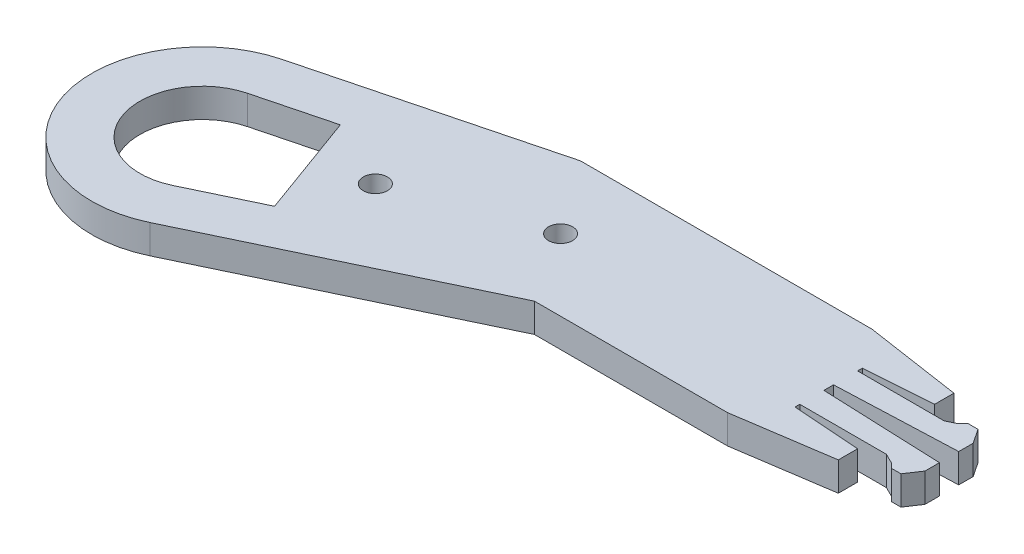
ISO-10303-21;
HEADER;
FILE_DESCRIPTION(('STEP AP214'),'2;1');
FILE_NAME('part.step','',(''),(''),'','','');
FILE_SCHEMA(('AUTOMOTIVE_DESIGN { 1 0 10303 214 1 1 1 1 }'));
ENDSEC;
DATA;
#1=APPLICATION_CONTEXT('core data for automotive mechanical design processes');
#2=APPLICATION_PROTOCOL_DEFINITION('international standard','automotive_design',2000,#1);
#3=PRODUCT_CONTEXT('',#1,'mechanical');
#4=PRODUCT('Part','Part','',(#3));
#5=PRODUCT_RELATED_PRODUCT_CATEGORY('part','',(#4));
#6=PRODUCT_DEFINITION_FORMATION('','',#4);
#7=PRODUCT_DEFINITION_CONTEXT('part definition',#1,'design');
#8=PRODUCT_DEFINITION('design','',#6,#7);
#9=PRODUCT_DEFINITION_SHAPE('','',#8);
#10=(LENGTH_UNIT() NAMED_UNIT(*) SI_UNIT(.MILLI.,.METRE.));
#11=(NAMED_UNIT(*) PLANE_ANGLE_UNIT() SI_UNIT($,.RADIAN.));
#12=(NAMED_UNIT(*) SI_UNIT($,.STERADIAN.) SOLID_ANGLE_UNIT());
#13=UNCERTAINTY_MEASURE_WITH_UNIT(LENGTH_MEASURE(1.E-05),#10,'distance_accuracy_value','');
#14=(GEOMETRIC_REPRESENTATION_CONTEXT(3) GLOBAL_UNCERTAINTY_ASSIGNED_CONTEXT((#13)) GLOBAL_UNIT_ASSIGNED_CONTEXT((#10,
#11,#12)) REPRESENTATION_CONTEXT('',''));
#15=CARTESIAN_POINT('',(0.,0.,0.));
#16=DIRECTION('',(0.,0.,1.));
#17=DIRECTION('',(1.,0.,0.));
#18=AXIS2_PLACEMENT_3D('',#15,#16,#17);
#19=CARTESIAN_POINT('',(-2.87937004662604,-3.,-11.1336978643482));
#20=DIRECTION('',(0.250380004054438,0.,0.968147640378109));
#21=DIRECTION('',(0.968147640378109,0.,-0.250380004054438));
#22=AXIS2_PLACEMENT_3D('',#19,#20,#21);
#23=PLANE('',#22);
#24=DIRECTION('',(0.968147640378109,0.,-0.250380004054438));
#25=VECTOR('',#24,1.);
#26=CARTESIAN_POINT('',(-2.87937004662604,0.,-11.1336978643482));
#27=LINE('',#26,#25);
#28=CARTESIAN_POINT('',(-2.87937004662604,0.,-11.1336978643482));
#29=VERTEX_POINT('',#28);
#30=CARTESIAN_POINT('',(21.7372937873807,0.,-17.5));
#31=VERTEX_POINT('',#30);
#32=EDGE_CURVE('E297',#29,#31,#27,.T.);
#33=ORIENTED_EDGE('',*,*,#32,.T.);
#34=DIRECTION('',(0.,1.,0.));
#35=VECTOR('',#34,1.);
#36=CARTESIAN_POINT('',(21.7372937873807,-3.,-17.5));
#37=LINE('',#36,#35);
#38=CARTESIAN_POINT('',(21.7372937873807,-3.,-17.5));
#39=VERTEX_POINT('',#38);
#40=EDGE_CURVE('E11',#39,#31,#37,.T.);
#41=ORIENTED_EDGE('',*,*,#40,.F.);
#42=DIRECTION('',(0.968147640378109,0.,-0.250380004054438));
#43=VECTOR('',#42,1.);
#44=CARTESIAN_POINT('',(-2.87937004662604,-3.,-11.1336978643482));
#45=LINE('',#44,#43);
#46=CARTESIAN_POINT('',(-2.87937004662604,-3.,-11.1336978643482));
#47=VERTEX_POINT('',#46);
#48=EDGE_CURVE('E54',#47,#39,#45,.T.);
#49=ORIENTED_EDGE('',*,*,#48,.F.);
#50=DIRECTION('',(0.,1.,0.));
#51=VECTOR('',#50,1.);
#52=CARTESIAN_POINT('',(-2.87937004662604,-3.,-11.1336978643482));
#53=LINE('',#52,#51);
#54=EDGE_CURVE('E432',#47,#29,#53,.T.);
#55=ORIENTED_EDGE('',*,*,#54,.T.);
#56=EDGE_LOOP('',(#33,#41,#49,#55));
#57=FACE_BOUND('',#56,.T.);
#58=ADVANCED_FACE('F35',(#57),#23,.F.);
#59=CARTESIAN_POINT('',(0.,-3.,-17.5));
#60=DIRECTION('',(0.,0.,-1.));
#61=DIRECTION('',(-1.,0.,0.));
#62=AXIS2_PLACEMENT_3D('',#59,#60,#61);
#63=PLANE('',#62);
#64=DIRECTION('',(-1.,0.,0.));
#65=VECTOR('',#64,1.);
#66=CARTESIAN_POINT('',(0.,0.,-17.5));
#67=LINE('',#66,#65);
#68=CARTESIAN_POINT('',(52.,0.,-17.5));
#69=VERTEX_POINT('',#68);
#70=EDGE_CURVE('E362',#69,#31,#67,.T.);
#71=ORIENTED_EDGE('',*,*,#70,.F.);
#72=DIRECTION('',(0.,1.,0.));
#73=VECTOR('',#72,1.);
#74=CARTESIAN_POINT('',(52.,-3.,-17.5));
#75=LINE('',#74,#73);
#76=CARTESIAN_POINT('',(52.,-3.,-17.5));
#77=VERTEX_POINT('',#76);
#78=EDGE_CURVE('E45',#77,#69,#75,.T.);
#79=ORIENTED_EDGE('',*,*,#78,.F.);
#80=DIRECTION('',(-1.,0.,0.));
#81=VECTOR('',#80,1.);
#82=CARTESIAN_POINT('',(0.,-3.,-17.5));
#83=LINE('',#82,#81);
#84=EDGE_CURVE('E270',#77,#39,#83,.T.);
#85=ORIENTED_EDGE('',*,*,#84,.T.);
#86=ORIENTED_EDGE('',*,*,#40,.T.);
#87=EDGE_LOOP('',(#71,#79,#85,#86));
#88=FACE_BOUND('',#87,.T.);
#89=ADVANCED_FACE('F621',(#88),#63,.T.);
#90=CARTESIAN_POINT('',(3.71149144254278,-3.,-24.7432762836186));
#91=DIRECTION('',(0.148340452930244,0.,-0.988936352868298));
#92=DIRECTION('',(-0.988936352868298,0.,-0.148340452930244));
#93=AXIS2_PLACEMENT_3D('',#90,#91,#92);
#94=PLANE('',#93);
#95=DIRECTION('',(-0.988936352868298,0.,-0.148340452930244));
#96=VECTOR('',#95,1.);
#97=CARTESIAN_POINT('',(3.71149144254278,0.,-24.7432762836186));
#98=LINE('',#97,#96);
#99=CARTESIAN_POINT('',(62.,0.,-16.));
#100=VERTEX_POINT('',#99);
#101=EDGE_CURVE('E257',#100,#69,#98,.T.);
#102=ORIENTED_EDGE('',*,*,#101,.F.);
#103=DIRECTION('',(0.,1.,0.));
#104=VECTOR('',#103,1.);
#105=CARTESIAN_POINT('',(62.,-3.,-16.));
#106=LINE('',#105,#104);
#107=CARTESIAN_POINT('',(62.,-3.,-16.));
#108=VERTEX_POINT('',#107);
#109=EDGE_CURVE('E253',#108,#100,#106,.T.);
#110=ORIENTED_EDGE('',*,*,#109,.F.);
#111=DIRECTION('',(-0.988936352868298,0.,-0.148340452930244));
#112=VECTOR('',#111,1.);
#113=CARTESIAN_POINT('',(3.71149144254278,-3.,-24.7432762836186));
#114=LINE('',#113,#112);
#115=EDGE_CURVE('E256',#108,#77,#114,.T.);
#116=ORIENTED_EDGE('',*,*,#115,.T.);
#117=ORIENTED_EDGE('',*,*,#78,.T.);
#118=EDGE_LOOP('',(#102,#110,#116,#117));
#119=FACE_BOUND('',#118,.T.);
#120=ADVANCED_FACE('F255',(#119),#94,.T.);
#121=CARTESIAN_POINT('',(62.,-3.,0.));
#122=DIRECTION('',(1.,0.,0.));
#123=DIRECTION('',(0.,0.,-1.));
#124=AXIS2_PLACEMENT_3D('',#121,#122,#123);
#125=PLANE('',#124);
#126=DIRECTION('',(0.,0.,-1.));
#127=VECTOR('',#126,1.);
#128=CARTESIAN_POINT('',(62.,0.,0.));
#129=LINE('',#128,#127);
#130=CARTESIAN_POINT('',(62.,0.,-14.));
#131=VERTEX_POINT('',#130);
#132=EDGE_CURVE('E359',#131,#100,#129,.T.);
#133=ORIENTED_EDGE('',*,*,#132,.F.);
#134=DIRECTION('',(0.,1.,0.));
#135=VECTOR('',#134,1.);
#136=CARTESIAN_POINT('',(62.,-3.,-14.));
#137=LINE('',#136,#135);
#138=CARTESIAN_POINT('',(62.,-3.,-14.));
#139=VERTEX_POINT('',#138);
#140=EDGE_CURVE('E262',#139,#131,#137,.T.);
#141=ORIENTED_EDGE('',*,*,#140,.F.);
#142=DIRECTION('',(0.,0.,-1.));
#143=VECTOR('',#142,1.);
#144=CARTESIAN_POINT('',(62.,-3.,0.));
#145=LINE('',#144,#143);
#146=EDGE_CURVE('E268',#139,#108,#145,.T.);
#147=ORIENTED_EDGE('',*,*,#146,.T.);
#148=ORIENTED_EDGE('',*,*,#109,.T.);
#149=EDGE_LOOP('',(#133,#141,#147,#148));
#150=FACE_BOUND('',#149,.T.);
#151=ADVANCED_FACE('F272',(#150),#125,.T.);
#152=CARTESIAN_POINT('',(-0.680203045685279,-3.,-9.5228426395939));
#153=DIRECTION('',(0.0712470499879097,0.,0.997458699830735));
#154=DIRECTION('',(0.997458699830735,0.,-0.0712470499879097));
#155=AXIS2_PLACEMENT_3D('',#152,#153,#154);
#156=PLANE('',#155);
#157=DIRECTION('',(0.997458699830735,0.,-0.0712470499879097));
#158=VECTOR('',#157,1.);
#159=CARTESIAN_POINT('',(-0.680203045685279,0.,-9.5228426395939));
#160=LINE('',#159,#158);
#161=CARTESIAN_POINT('',(55.,0.,-13.5));
#162=VERTEX_POINT('',#161);
#163=EDGE_CURVE('E356',#162,#131,#160,.T.);
#164=ORIENTED_EDGE('',*,*,#163,.F.);
#165=DIRECTION('',(0.,1.,0.));
#166=VECTOR('',#165,1.);
#167=CARTESIAN_POINT('',(55.,-3.,-13.5));
#168=LINE('',#167,#166);
#169=CARTESIAN_POINT('',(55.,-3.,-13.5));
#170=VERTEX_POINT('',#169);
#171=EDGE_CURVE('E374',#170,#162,#168,.T.);
#172=ORIENTED_EDGE('',*,*,#171,.F.);
#173=DIRECTION('',(0.997458699830735,0.,-0.0712470499879097));
#174=VECTOR('',#173,1.);
#175=CARTESIAN_POINT('',(-0.680203045685279,-3.,-9.5228426395939));
#176=LINE('',#175,#174);
#177=EDGE_CURVE('E273',#170,#139,#176,.T.);
#178=ORIENTED_EDGE('',*,*,#177,.T.);
#179=ORIENTED_EDGE('',*,*,#140,.T.);
#180=EDGE_LOOP('',(#164,#172,#178,#179));
#181=FACE_BOUND('',#180,.T.);
#182=ADVANCED_FACE('F624',(#181),#156,.T.);
#183=CARTESIAN_POINT('',(54.9999999999998,-3.,7.63278329429795E-13));
#184=DIRECTION('',(1.,0.,0.));
#185=DIRECTION('',(0.,0.,-1.));
#186=AXIS2_PLACEMENT_3D('',#183,#184,#185);
#187=PLANE('',#186);
#188=DIRECTION('',(0.,0.,-1.));
#189=VECTOR('',#188,1.);
#190=CARTESIAN_POINT('',(54.9999999999998,0.,7.63278329429795E-13));
#191=LINE('',#190,#189);
#192=CARTESIAN_POINT('',(55.,0.,-13.));
#193=VERTEX_POINT('',#192);
#194=EDGE_CURVE('E353',#193,#162,#191,.T.);
#195=ORIENTED_EDGE('',*,*,#194,.F.);
#196=DIRECTION('',(0.,1.,0.));
#197=VECTOR('',#196,1.);
#198=CARTESIAN_POINT('',(55.,-3.,-13.));
#199=LINE('',#198,#197);
#200=CARTESIAN_POINT('',(55.,-3.,-13.));
#201=VERTEX_POINT('',#200);
#202=EDGE_CURVE('E376',#201,#193,#199,.T.);
#203=ORIENTED_EDGE('',*,*,#202,.F.);
#204=DIRECTION('',(0.,0.,-1.));
#205=VECTOR('',#204,1.);
#206=CARTESIAN_POINT('',(54.9999999999998,-3.,7.63278329429795E-13));
#207=LINE('',#206,#205);
#208=EDGE_CURVE('E275',#201,#170,#207,.T.);
#209=ORIENTED_EDGE('',*,*,#208,.T.);
#210=ORIENTED_EDGE('',*,*,#171,.T.);
#211=EDGE_LOOP('',(#195,#203,#209,#210));
#212=FACE_BOUND('',#211,.T.);
#213=ADVANCED_FACE('F518',(#212),#187,.T.);
#214=CARTESIAN_POINT('',(0.,-3.,-13.));
#215=DIRECTION('',(0.,0.,-1.));
#216=DIRECTION('',(-1.,0.,0.));
#217=AXIS2_PLACEMENT_3D('',#214,#215,#216);
#218=PLANE('',#217);
#219=DIRECTION('',(-1.,0.,0.));
#220=VECTOR('',#219,1.);
#221=CARTESIAN_POINT('',(0.,0.,-13.));
#222=LINE('',#221,#220);
#223=CARTESIAN_POINT('',(64.,0.,-13.));
#224=VERTEX_POINT('',#223);
#225=EDGE_CURVE('E350',#224,#193,#222,.T.);
#226=ORIENTED_EDGE('',*,*,#225,.F.);
#227=DIRECTION('',(0.,1.,0.));
#228=VECTOR('',#227,1.);
#229=CARTESIAN_POINT('',(64.,-3.,-13.));
#230=LINE('',#229,#228);
#231=CARTESIAN_POINT('',(64.,-3.,-13.));
#232=VERTEX_POINT('',#231);
#233=EDGE_CURVE('E378',#232,#224,#230,.T.);
#234=ORIENTED_EDGE('',*,*,#233,.F.);
#235=DIRECTION('',(-1.,0.,0.));
#236=VECTOR('',#235,1.);
#237=CARTESIAN_POINT('',(0.,-3.,-13.));
#238=LINE('',#237,#236);
#239=EDGE_CURVE('E512',#232,#201,#238,.T.);
#240=ORIENTED_EDGE('',*,*,#239,.T.);
#241=ORIENTED_EDGE('',*,*,#202,.T.);
#242=EDGE_LOOP('',(#226,#234,#240,#241));
#243=FACE_BOUND('',#242,.T.);
#244=ADVANCED_FACE('F524',(#243),#218,.T.);
#245=CARTESIAN_POINT('',(7.59999999999994,-3.,15.1999999999999));
#246=DIRECTION('',(-0.447213595499957,0.,-0.894427190999917));
#247=DIRECTION('',(-0.894427190999917,0.,0.447213595499957));
#248=AXIS2_PLACEMENT_3D('',#245,#246,#247);
#249=PLANE('',#248);
#250=DIRECTION('',(-0.894427190999917,0.,0.447213595499957));
#251=VECTOR('',#250,1.);
#252=CARTESIAN_POINT('',(7.59999999999994,0.,15.1999999999999));
#253=LINE('',#252,#251);
#254=CARTESIAN_POINT('',(65.,0.,-13.5));
#255=VERTEX_POINT('',#254);
#256=EDGE_CURVE('E347',#255,#224,#253,.T.);
#257=ORIENTED_EDGE('',*,*,#256,.F.);
#258=DIRECTION('',(0.,1.,0.));
#259=VECTOR('',#258,1.);
#260=CARTESIAN_POINT('',(65.,-3.,-13.5));
#261=LINE('',#260,#259);
#262=CARTESIAN_POINT('',(65.,-3.,-13.5));
#263=VERTEX_POINT('',#262);
#264=EDGE_CURVE('E380',#263,#255,#261,.T.);
#265=ORIENTED_EDGE('',*,*,#264,.F.);
#266=DIRECTION('',(-0.894427190999917,0.,0.447213595499957));
#267=VECTOR('',#266,1.);
#268=CARTESIAN_POINT('',(7.59999999999994,-3.,15.1999999999999));
#269=LINE('',#268,#267);
#270=EDGE_CURVE('E509',#263,#232,#269,.T.);
#271=ORIENTED_EDGE('',*,*,#270,.T.);
#272=ORIENTED_EDGE('',*,*,#233,.T.);
#273=EDGE_LOOP('',(#257,#265,#271,#272));
#274=FACE_BOUND('',#273,.T.);
#275=ADVANCED_FACE('F527',(#274),#249,.T.);
#276=CARTESIAN_POINT('',(25.75,-3.,25.75));
#277=DIRECTION('',(-0.707106781186547,0.,-0.707106781186547));
#278=DIRECTION('',(-0.707106781186548,0.,0.707106781186548));
#279=AXIS2_PLACEMENT_3D('',#276,#277,#278);
#280=PLANE('',#279);
#281=DIRECTION('',(-0.707106781186548,0.,0.707106781186548));
#282=VECTOR('',#281,1.);
#283=CARTESIAN_POINT('',(25.75,0.,25.75));
#284=LINE('',#283,#282);
#285=CARTESIAN_POINT('',(65.5,0.,-14.));
#286=VERTEX_POINT('',#285);
#287=EDGE_CURVE('E344',#286,#255,#284,.T.);
#288=ORIENTED_EDGE('',*,*,#287,.F.);
#289=DIRECTION('',(0.,1.,0.));
#290=VECTOR('',#289,1.);
#291=CARTESIAN_POINT('',(65.5,-3.,-14.));
#292=LINE('',#291,#290);
#293=CARTESIAN_POINT('',(65.5,-3.,-14.));
#294=VERTEX_POINT('',#293);
#295=EDGE_CURVE('E382',#294,#286,#292,.T.);
#296=ORIENTED_EDGE('',*,*,#295,.F.);
#297=DIRECTION('',(-0.707106781186548,0.,0.707106781186548));
#298=VECTOR('',#297,1.);
#299=CARTESIAN_POINT('',(25.75,-3.,25.75));
#300=LINE('',#299,#298);
#301=EDGE_CURVE('E506',#294,#263,#300,.T.);
#302=ORIENTED_EDGE('',*,*,#301,.T.);
#303=ORIENTED_EDGE('',*,*,#264,.T.);
#304=EDGE_LOOP('',(#288,#296,#302,#303));
#305=FACE_BOUND('',#304,.T.);
#306=ADVANCED_FACE('F532',(#305),#280,.T.);
#307=CARTESIAN_POINT('',(0.,-3.,-13.9999999999999));
#308=DIRECTION('',(0.,0.,-1.));
#309=DIRECTION('',(-1.,0.,0.));
#310=AXIS2_PLACEMENT_3D('',#307,#308,#309);
#311=PLANE('',#310);
#312=DIRECTION('',(-1.,0.,0.));
#313=VECTOR('',#312,1.);
#314=CARTESIAN_POINT('',(0.,0.,-13.9999999999999));
#315=LINE('',#314,#313);
#316=CARTESIAN_POINT('',(66.5,0.,-14.));
#317=VERTEX_POINT('',#316);
#318=EDGE_CURVE('E341',#317,#286,#315,.T.);
#319=ORIENTED_EDGE('',*,*,#318,.F.);
#320=DIRECTION('',(0.,1.,0.));
#321=VECTOR('',#320,1.);
#322=CARTESIAN_POINT('',(66.5,-3.,-14.));
#323=LINE('',#322,#321);
#324=CARTESIAN_POINT('',(66.5,-3.,-14.));
#325=VERTEX_POINT('',#324);
#326=EDGE_CURVE('E384',#325,#317,#323,.T.);
#327=ORIENTED_EDGE('',*,*,#326,.F.);
#328=DIRECTION('',(-1.,0.,0.));
#329=VECTOR('',#328,1.);
#330=CARTESIAN_POINT('',(0.,-3.,-13.9999999999999));
#331=LINE('',#330,#329);
#332=EDGE_CURVE('E503',#325,#294,#331,.T.);
#333=ORIENTED_EDGE('',*,*,#332,.T.);
#334=ORIENTED_EDGE('',*,*,#295,.T.);
#335=EDGE_LOOP('',(#319,#327,#333,#334));
#336=FACE_BOUND('',#335,.T.);
#337=ADVANCED_FACE('F535',(#336),#311,.T.);
#338=CARTESIAN_POINT('',(52.5,-3.,-35.));
#339=DIRECTION('',(0.832050294337843,0.,-0.554700196225229));
#340=DIRECTION('',(-0.554700196225229,0.,-0.832050294337844));
#341=AXIS2_PLACEMENT_3D('',#338,#339,#340);
#342=PLANE('',#341);
#343=DIRECTION('',(-0.554700196225229,0.,-0.832050294337844));
#344=VECTOR('',#343,1.);
#345=CARTESIAN_POINT('',(52.5,0.,-35.));
#346=LINE('',#345,#344);
#347=CARTESIAN_POINT('',(67.5,0.,-12.5));
#348=VERTEX_POINT('',#347);
#349=EDGE_CURVE('E338',#348,#317,#346,.T.);
#350=ORIENTED_EDGE('',*,*,#349,.F.);
#351=DIRECTION('',(0.,1.,0.));
#352=VECTOR('',#351,1.);
#353=CARTESIAN_POINT('',(67.5,-3.,-12.5));
#354=LINE('',#353,#352);
#355=CARTESIAN_POINT('',(67.5,-3.,-12.5));
#356=VERTEX_POINT('',#355);
#357=EDGE_CURVE('E386',#356,#348,#354,.T.);
#358=ORIENTED_EDGE('',*,*,#357,.F.);
#359=DIRECTION('',(-0.554700196225229,0.,-0.832050294337844));
#360=VECTOR('',#359,1.);
#361=CARTESIAN_POINT('',(52.5,-3.,-35.));
#362=LINE('',#361,#360);
#363=EDGE_CURVE('E500',#356,#325,#362,.T.);
#364=ORIENTED_EDGE('',*,*,#363,.T.);
#365=ORIENTED_EDGE('',*,*,#326,.T.);
#366=EDGE_LOOP('',(#350,#358,#364,#365));
#367=FACE_BOUND('',#366,.T.);
#368=ADVANCED_FACE('F540',(#367),#342,.T.);
#369=CARTESIAN_POINT('',(67.5,-3.,0.));
#370=DIRECTION('',(1.,0.,0.));
#371=DIRECTION('',(0.,0.,-1.));
#372=AXIS2_PLACEMENT_3D('',#369,#370,#371);
#373=PLANE('',#372);
#374=DIRECTION('',(0.,0.,-1.));
#375=VECTOR('',#374,1.);
#376=CARTESIAN_POINT('',(67.5,0.,0.));
#377=LINE('',#376,#375);
#378=CARTESIAN_POINT('',(67.5,0.,-11.));
#379=VERTEX_POINT('',#378);
#380=EDGE_CURVE('E335',#379,#348,#377,.T.);
#381=ORIENTED_EDGE('',*,*,#380,.F.);
#382=DIRECTION('',(0.,1.,0.));
#383=VECTOR('',#382,1.);
#384=CARTESIAN_POINT('',(67.5,-3.,-11.));
#385=LINE('',#384,#383);
#386=CARTESIAN_POINT('',(67.5,-3.,-11.));
#387=VERTEX_POINT('',#386);
#388=EDGE_CURVE('E388',#387,#379,#385,.T.);
#389=ORIENTED_EDGE('',*,*,#388,.F.);
#390=DIRECTION('',(0.,0.,-1.));
#391=VECTOR('',#390,1.);
#392=CARTESIAN_POINT('',(67.5,-3.,0.));
#393=LINE('',#392,#391);
#394=EDGE_CURVE('E497',#387,#356,#393,.T.);
#395=ORIENTED_EDGE('',*,*,#394,.T.);
#396=ORIENTED_EDGE('',*,*,#357,.T.);
#397=EDGE_LOOP('',(#381,#389,#395,#396));
#398=FACE_BOUND('',#397,.T.);
#399=ADVANCED_FACE('F543',(#398),#373,.T.);
#400=CARTESIAN_POINT('',(-0.3314696485623,-3.,-8.28674121405751));
#401=DIRECTION('',(0.0399680383488715,0.,0.999200958721789));
#402=DIRECTION('',(0.99920095872179,0.,-0.0399680383488715));
#403=AXIS2_PLACEMENT_3D('',#400,#401,#402);
#404=PLANE('',#403);
#405=DIRECTION('',(0.999200958721789,0.,-0.0399680383488715));
#406=VECTOR('',#405,1.);
#407=CARTESIAN_POINT('',(-0.3314696485623,0.,-8.28674121405751));
#408=LINE('',#407,#406);
#409=CARTESIAN_POINT('',(55.,0.,-10.5));
#410=VERTEX_POINT('',#409);
#411=EDGE_CURVE('E332',#410,#379,#408,.T.);
#412=ORIENTED_EDGE('',*,*,#411,.F.);
#413=DIRECTION('',(0.,1.,0.));
#414=VECTOR('',#413,1.);
#415=CARTESIAN_POINT('',(55.,-3.,-10.5));
#416=LINE('',#415,#414);
#417=CARTESIAN_POINT('',(55.,-3.,-10.5));
#418=VERTEX_POINT('',#417);
#419=EDGE_CURVE('E390',#418,#410,#416,.T.);
#420=ORIENTED_EDGE('',*,*,#419,.F.);
#421=DIRECTION('',(0.999200958721789,0.,-0.0399680383488715));
#422=VECTOR('',#421,1.);
#423=CARTESIAN_POINT('',(-0.3314696485623,-3.,-8.28674121405751));
#424=LINE('',#423,#422);
#425=EDGE_CURVE('E494',#418,#387,#424,.T.);
#426=ORIENTED_EDGE('',*,*,#425,.T.);
#427=ORIENTED_EDGE('',*,*,#388,.T.);
#428=EDGE_LOOP('',(#412,#420,#426,#427));
#429=FACE_BOUND('',#428,.T.);
#430=ADVANCED_FACE('F547',(#429),#404,.T.);
#431=CARTESIAN_POINT('',(55.,-3.,0.));
#432=DIRECTION('',(-1.,0.,0.));
#433=DIRECTION('',(0.,0.,1.));
#434=AXIS2_PLACEMENT_3D('',#431,#432,#433);
#435=PLANE('',#434);
#436=DIRECTION('',(0.,0.,1.));
#437=VECTOR('',#436,1.);
#438=CARTESIAN_POINT('',(55.,0.,0.));
#439=LINE('',#438,#437);
#440=CARTESIAN_POINT('',(55.,0.,-9.5));
#441=VERTEX_POINT('',#440);
#442=EDGE_CURVE('E330',#410,#441,#439,.T.);
#443=ORIENTED_EDGE('',*,*,#442,.T.);
#444=DIRECTION('',(0.,1.,0.));
#445=VECTOR('',#444,1.);
#446=CARTESIAN_POINT('',(55.,-3.,-9.5));
#447=LINE('',#446,#445);
#448=CARTESIAN_POINT('',(55.,-3.,-9.5));
#449=VERTEX_POINT('',#448);
#450=EDGE_CURVE('E392',#449,#441,#447,.T.);
#451=ORIENTED_EDGE('',*,*,#450,.F.);
#452=DIRECTION('',(0.,0.,1.));
#453=VECTOR('',#452,1.);
#454=CARTESIAN_POINT('',(55.,-3.,0.));
#455=LINE('',#454,#453);
#456=EDGE_CURVE('E492',#418,#449,#455,.T.);
#457=ORIENTED_EDGE('',*,*,#456,.F.);
#458=ORIENTED_EDGE('',*,*,#419,.T.);
#459=EDGE_LOOP('',(#443,#451,#457,#458));
#460=FACE_BOUND('',#459,.T.);
#461=ADVANCED_FACE('F552',(#460),#435,.F.);
#462=CARTESIAN_POINT('',(0.467252396166133,-3.,-11.6813099041533));
#463=DIRECTION('',(-0.0399680383488715,0.,0.999200958721789));
#464=DIRECTION('',(0.99920095872179,0.,0.0399680383488715));
#465=AXIS2_PLACEMENT_3D('',#462,#463,#464);
#466=PLANE('',#465);
#467=DIRECTION('',(0.999200958721789,0.,0.0399680383488715));
#468=VECTOR('',#467,1.);
#469=CARTESIAN_POINT('',(0.467252396166133,0.,-11.6813099041533));
#470=LINE('',#469,#468);
#471=CARTESIAN_POINT('',(67.5,0.,-9.));
#472=VERTEX_POINT('',#471);
#473=EDGE_CURVE('E328',#441,#472,#470,.T.);
#474=ORIENTED_EDGE('',*,*,#473,.T.);
#475=DIRECTION('',(0.,1.,0.));
#476=VECTOR('',#475,1.);
#477=CARTESIAN_POINT('',(67.5,-3.,-9.));
#478=LINE('',#477,#476);
#479=CARTESIAN_POINT('',(67.5,-3.,-9.));
#480=VERTEX_POINT('',#479);
#481=EDGE_CURVE('E395',#480,#472,#478,.T.);
#482=ORIENTED_EDGE('',*,*,#481,.F.);
#483=DIRECTION('',(0.999200958721789,0.,0.0399680383488715));
#484=VECTOR('',#483,1.);
#485=CARTESIAN_POINT('',(0.467252396166133,-3.,-11.6813099041533));
#486=LINE('',#485,#484);
#487=EDGE_CURVE('E490',#449,#480,#486,.T.);
#488=ORIENTED_EDGE('',*,*,#487,.F.);
#489=ORIENTED_EDGE('',*,*,#450,.T.);
#490=EDGE_LOOP('',(#474,#482,#488,#489));
#491=FACE_BOUND('',#490,.T.);
#492=ADVANCED_FACE('F558',(#491),#466,.F.);
#493=CARTESIAN_POINT('',(67.5,-3.,0.));
#494=DIRECTION('',(-1.,0.,0.));
#495=DIRECTION('',(0.,0.,1.));
#496=AXIS2_PLACEMENT_3D('',#493,#494,#495);
#497=PLANE('',#496);
#498=DIRECTION('',(0.,0.,1.));
#499=VECTOR('',#498,1.);
#500=CARTESIAN_POINT('',(67.5,0.,0.));
#501=LINE('',#500,#499);
#502=CARTESIAN_POINT('',(67.5,0.,-7.5));
#503=VERTEX_POINT('',#502);
#504=EDGE_CURVE('E326',#472,#503,#501,.T.);
#505=ORIENTED_EDGE('',*,*,#504,.T.);
#506=DIRECTION('',(0.,1.,0.));
#507=VECTOR('',#506,1.);
#508=CARTESIAN_POINT('',(67.5,-3.,-7.5));
#509=LINE('',#508,#507);
#510=CARTESIAN_POINT('',(67.5,-3.,-7.5));
#511=VERTEX_POINT('',#510);
#512=EDGE_CURVE('E398',#511,#503,#509,.T.);
#513=ORIENTED_EDGE('',*,*,#512,.F.);
#514=DIRECTION('',(0.,0.,1.));
#515=VECTOR('',#514,1.);
#516=CARTESIAN_POINT('',(67.5,-3.,0.));
#517=LINE('',#516,#515);
#518=EDGE_CURVE('E488',#480,#511,#517,.T.);
#519=ORIENTED_EDGE('',*,*,#518,.F.);
#520=ORIENTED_EDGE('',*,*,#481,.T.);
#521=EDGE_LOOP('',(#505,#513,#519,#520));
#522=FACE_BOUND('',#521,.T.);
#523=ADVANCED_FACE('F562',(#522),#497,.F.);
#524=CARTESIAN_POINT('',(43.2692307692307,-3.,28.8461538461538));
#525=DIRECTION('',(-0.832050294337843,0.,-0.554700196225229));
#526=DIRECTION('',(-0.554700196225229,0.,0.832050294337844));
#527=AXIS2_PLACEMENT_3D('',#524,#525,#526);
#528=PLANE('',#527);
#529=DIRECTION('',(-0.554700196225229,0.,0.832050294337844));
#530=VECTOR('',#529,1.);
#531=CARTESIAN_POINT('',(43.2692307692307,0.,28.8461538461538));
#532=LINE('',#531,#530);
#533=CARTESIAN_POINT('',(66.5,0.,-6.));
#534=VERTEX_POINT('',#533);
#535=EDGE_CURVE('E324',#503,#534,#532,.T.);
#536=ORIENTED_EDGE('',*,*,#535,.T.);
#537=DIRECTION('',(0.,1.,0.));
#538=VECTOR('',#537,1.);
#539=CARTESIAN_POINT('',(66.5,-3.,-6.));
#540=LINE('',#539,#538);
#541=CARTESIAN_POINT('',(66.5,-3.,-6.));
#542=VERTEX_POINT('',#541);
#543=EDGE_CURVE('E401',#542,#534,#540,.T.);
#544=ORIENTED_EDGE('',*,*,#543,.F.);
#545=DIRECTION('',(-0.554700196225229,0.,0.832050294337844));
#546=VECTOR('',#545,1.);
#547=CARTESIAN_POINT('',(43.2692307692307,-3.,28.8461538461538));
#548=LINE('',#547,#546);
#549=EDGE_CURVE('E486',#511,#542,#548,.T.);
#550=ORIENTED_EDGE('',*,*,#549,.F.);
#551=ORIENTED_EDGE('',*,*,#512,.T.);
#552=EDGE_LOOP('',(#536,#544,#550,#551));
#553=FACE_BOUND('',#552,.T.);
#554=ADVANCED_FACE('F567',(#553),#528,.F.);
#555=CARTESIAN_POINT('',(0.,-3.,-6.00000000000006));
#556=DIRECTION('',(0.,0.,-1.));
#557=DIRECTION('',(-1.,0.,0.));
#558=AXIS2_PLACEMENT_3D('',#555,#556,#557);
#559=PLANE('',#558);
#560=DIRECTION('',(-1.,0.,0.));
#561=VECTOR('',#560,1.);
#562=CARTESIAN_POINT('',(0.,0.,-6.00000000000006));
#563=LINE('',#562,#561);
#564=CARTESIAN_POINT('',(65.5,0.,-6.));
#565=VERTEX_POINT('',#564);
#566=EDGE_CURVE('E322',#534,#565,#563,.T.);
#567=ORIENTED_EDGE('',*,*,#566,.T.);
#568=DIRECTION('',(0.,1.,0.));
#569=VECTOR('',#568,1.);
#570=CARTESIAN_POINT('',(65.5,-3.,-6.));
#571=LINE('',#570,#569);
#572=CARTESIAN_POINT('',(65.5,-3.,-6.));
#573=VERTEX_POINT('',#572);
#574=EDGE_CURVE('E404',#573,#565,#571,.T.);
#575=ORIENTED_EDGE('',*,*,#574,.F.);
#576=DIRECTION('',(-1.,0.,0.));
#577=VECTOR('',#576,1.);
#578=CARTESIAN_POINT('',(0.,-3.,-6.00000000000006));
#579=LINE('',#578,#577);
#580=EDGE_CURVE('E484',#542,#573,#579,.T.);
#581=ORIENTED_EDGE('',*,*,#580,.F.);
#582=ORIENTED_EDGE('',*,*,#543,.T.);
#583=EDGE_LOOP('',(#567,#575,#581,#582));
#584=FACE_BOUND('',#583,.T.);
#585=ADVANCED_FACE('F573',(#584),#559,.F.);
#586=CARTESIAN_POINT('',(35.75,-3.,-35.75));
#587=DIRECTION('',(0.707106781186547,0.,-0.707106781186547));
#588=DIRECTION('',(-0.707106781186548,0.,-0.707106781186548));
#589=AXIS2_PLACEMENT_3D('',#586,#587,#588);
#590=PLANE('',#589);
#591=DIRECTION('',(-0.707106781186548,0.,-0.707106781186548));
#592=VECTOR('',#591,1.);
#593=CARTESIAN_POINT('',(35.75,0.,-35.75));
#594=LINE('',#593,#592);
#595=CARTESIAN_POINT('',(65.,0.,-6.49999999999998));
#596=VERTEX_POINT('',#595);
#597=EDGE_CURVE('E320',#565,#596,#594,.T.);
#598=ORIENTED_EDGE('',*,*,#597,.T.);
#599=DIRECTION('',(0.,1.,0.));
#600=VECTOR('',#599,1.);
#601=CARTESIAN_POINT('',(65.,-3.,-6.49999999999998));
#602=LINE('',#601,#600);
#603=CARTESIAN_POINT('',(65.,-3.,-6.49999999999998));
#604=VERTEX_POINT('',#603);
#605=EDGE_CURVE('E407',#604,#596,#602,.T.);
#606=ORIENTED_EDGE('',*,*,#605,.F.);
#607=DIRECTION('',(-0.707106781186548,0.,-0.707106781186548));
#608=VECTOR('',#607,1.);
#609=CARTESIAN_POINT('',(35.75,-3.,-35.75));
#610=LINE('',#609,#608);
#611=EDGE_CURVE('E482',#573,#604,#610,.T.);
#612=ORIENTED_EDGE('',*,*,#611,.F.);
#613=ORIENTED_EDGE('',*,*,#574,.T.);
#614=EDGE_LOOP('',(#598,#606,#612,#613));
#615=FACE_BOUND('',#614,.T.);
#616=ADVANCED_FACE('F577',(#615),#590,.F.);
#617=CARTESIAN_POINT('',(15.6,-3.,-31.2));
#618=DIRECTION('',(0.447213595499957,0.,-0.894427190999916));
#619=DIRECTION('',(-0.894427190999916,0.,-0.447213595499957));
#620=AXIS2_PLACEMENT_3D('',#617,#618,#619);
#621=PLANE('',#620);
#622=DIRECTION('',(-0.894427190999916,0.,-0.447213595499957));
#623=VECTOR('',#622,1.);
#624=CARTESIAN_POINT('',(15.6,0.,-31.2));
#625=LINE('',#624,#623);
#626=CARTESIAN_POINT('',(64.,0.,-7.));
#627=VERTEX_POINT('',#626);
#628=EDGE_CURVE('E318',#596,#627,#625,.T.);
#629=ORIENTED_EDGE('',*,*,#628,.T.);
#630=DIRECTION('',(0.,1.,0.));
#631=VECTOR('',#630,1.);
#632=CARTESIAN_POINT('',(64.,-3.,-7.));
#633=LINE('',#632,#631);
#634=CARTESIAN_POINT('',(64.,-3.,-7.));
#635=VERTEX_POINT('',#634);
#636=EDGE_CURVE('E410',#635,#627,#633,.T.);
#637=ORIENTED_EDGE('',*,*,#636,.F.);
#638=DIRECTION('',(-0.894427190999916,0.,-0.447213595499957));
#639=VECTOR('',#638,1.);
#640=CARTESIAN_POINT('',(15.6,-3.,-31.2));
#641=LINE('',#640,#639);
#642=EDGE_CURVE('E480',#604,#635,#641,.T.);
#643=ORIENTED_EDGE('',*,*,#642,.F.);
#644=ORIENTED_EDGE('',*,*,#605,.T.);
#645=EDGE_LOOP('',(#629,#637,#643,#644));
#646=FACE_BOUND('',#645,.T.);
#647=ADVANCED_FACE('F582',(#646),#621,.F.);
#648=CARTESIAN_POINT('',(0.,-3.,-7.00000000000001));
#649=DIRECTION('',(0.,0.,-1.));
#650=DIRECTION('',(-1.,0.,0.));
#651=AXIS2_PLACEMENT_3D('',#648,#649,#650);
#652=PLANE('',#651);
#653=DIRECTION('',(-1.,0.,0.));
#654=VECTOR('',#653,1.);
#655=CARTESIAN_POINT('',(0.,0.,-7.00000000000001));
#656=LINE('',#655,#654);
#657=CARTESIAN_POINT('',(55.,0.,-7.));
#658=VERTEX_POINT('',#657);
#659=EDGE_CURVE('E316',#627,#658,#656,.T.);
#660=ORIENTED_EDGE('',*,*,#659,.T.);
#661=DIRECTION('',(0.,1.,0.));
#662=VECTOR('',#661,1.);
#663=CARTESIAN_POINT('',(55.,-3.,-7.));
#664=LINE('',#663,#662);
#665=CARTESIAN_POINT('',(55.,-3.,-7.));
#666=VERTEX_POINT('',#665);
#667=EDGE_CURVE('E413',#666,#658,#664,.T.);
#668=ORIENTED_EDGE('',*,*,#667,.F.);
#669=DIRECTION('',(-1.,0.,0.));
#670=VECTOR('',#669,1.);
#671=CARTESIAN_POINT('',(0.,-3.,-7.00000000000001));
#672=LINE('',#671,#670);
#673=EDGE_CURVE('E478',#635,#666,#672,.T.);
#674=ORIENTED_EDGE('',*,*,#673,.F.);
#675=ORIENTED_EDGE('',*,*,#636,.T.);
#676=EDGE_LOOP('',(#660,#668,#674,#675));
#677=FACE_BOUND('',#676,.T.);
#678=ADVANCED_FACE('F588',(#677),#652,.F.);
#679=CARTESIAN_POINT('',(55.0000000000001,-3.,-7.63278329429797E-13));
#680=DIRECTION('',(-1.,0.,0.));
#681=DIRECTION('',(0.,0.,1.));
#682=AXIS2_PLACEMENT_3D('',#679,#680,#681);
#683=PLANE('',#682);
#684=DIRECTION('',(0.,0.,1.));
#685=VECTOR('',#684,1.);
#686=CARTESIAN_POINT('',(55.0000000000001,0.,-7.63278329429797E-13));
#687=LINE('',#686,#685);
#688=CARTESIAN_POINT('',(55.,0.,-6.5));
#689=VERTEX_POINT('',#688);
#690=EDGE_CURVE('E314',#658,#689,#687,.T.);
#691=ORIENTED_EDGE('',*,*,#690,.T.);
#692=DIRECTION('',(0.,1.,0.));
#693=VECTOR('',#692,1.);
#694=CARTESIAN_POINT('',(55.,-3.,-6.5));
#695=LINE('',#694,#693);
#696=CARTESIAN_POINT('',(55.,-3.,-6.5));
#697=VERTEX_POINT('',#696);
#698=EDGE_CURVE('E416',#697,#689,#695,.T.);
#699=ORIENTED_EDGE('',*,*,#698,.F.);
#700=DIRECTION('',(0.,0.,1.));
#701=VECTOR('',#700,1.);
#702=CARTESIAN_POINT('',(55.0000000000001,-3.,-7.63278329429797E-13));
#703=LINE('',#702,#701);
#704=EDGE_CURVE('E476',#666,#697,#703,.T.);
#705=ORIENTED_EDGE('',*,*,#704,.F.);
#706=ORIENTED_EDGE('',*,*,#667,.T.);
#707=EDGE_LOOP('',(#691,#699,#705,#706));
#708=FACE_BOUND('',#707,.T.);
#709=ADVANCED_FACE('F592',(#708),#683,.F.);
#710=CARTESIAN_POINT('',(0.741116751269035,-3.,-10.3756345177665));
#711=DIRECTION('',(-0.0712470499879096,0.,0.997458699830735));
#712=DIRECTION('',(0.997458699830735,0.,0.0712470499879096));
#713=AXIS2_PLACEMENT_3D('',#710,#711,#712);
#714=PLANE('',#713);
#715=DIRECTION('',(0.997458699830735,0.,0.0712470499879096));
#716=VECTOR('',#715,1.);
#717=CARTESIAN_POINT('',(0.741116751269035,0.,-10.3756345177665));
#718=LINE('',#717,#716);
#719=CARTESIAN_POINT('',(62.,0.,-6.));
#720=VERTEX_POINT('',#719);
#721=EDGE_CURVE('E312',#689,#720,#718,.T.);
#722=ORIENTED_EDGE('',*,*,#721,.T.);
#723=DIRECTION('',(0.,1.,0.));
#724=VECTOR('',#723,1.);
#725=CARTESIAN_POINT('',(62.,-3.,-6.));
#726=LINE('',#725,#724);
#727=CARTESIAN_POINT('',(62.,-3.,-6.));
#728=VERTEX_POINT('',#727);
#729=EDGE_CURVE('E419',#728,#720,#726,.T.);
#730=ORIENTED_EDGE('',*,*,#729,.F.);
#731=DIRECTION('',(0.997458699830735,0.,0.0712470499879096));
#732=VECTOR('',#731,1.);
#733=CARTESIAN_POINT('',(0.741116751269035,-3.,-10.3756345177665));
#734=LINE('',#733,#732);
#735=EDGE_CURVE('E474',#697,#728,#734,.T.);
#736=ORIENTED_EDGE('',*,*,#735,.F.);
#737=ORIENTED_EDGE('',*,*,#698,.T.);
#738=EDGE_LOOP('',(#722,#730,#736,#737));
#739=FACE_BOUND('',#738,.T.);
#740=ADVANCED_FACE('F597',(#739),#714,.F.);
#741=CARTESIAN_POINT('',(62.,-3.,0.));
#742=DIRECTION('',(-1.,0.,0.));
#743=DIRECTION('',(0.,0.,1.));
#744=AXIS2_PLACEMENT_3D('',#741,#742,#743);
#745=PLANE('',#744);
#746=DIRECTION('',(0.,0.,1.));
#747=VECTOR('',#746,1.);
#748=CARTESIAN_POINT('',(62.,0.,0.));
#749=LINE('',#748,#747);
#750=CARTESIAN_POINT('',(62.,0.,-4.));
#751=VERTEX_POINT('',#750);
#752=EDGE_CURVE('E310',#720,#751,#749,.T.);
#753=ORIENTED_EDGE('',*,*,#752,.T.);
#754=DIRECTION('',(0.,1.,0.));
#755=VECTOR('',#754,1.);
#756=CARTESIAN_POINT('',(62.,-3.,-4.));
#757=LINE('',#756,#755);
#758=CARTESIAN_POINT('',(62.,-3.,-4.));
#759=VERTEX_POINT('',#758);
#760=EDGE_CURVE('E422',#759,#751,#757,.T.);
#761=ORIENTED_EDGE('',*,*,#760,.F.);
#762=DIRECTION('',(0.,0.,1.));
#763=VECTOR('',#762,1.);
#764=CARTESIAN_POINT('',(62.,-3.,0.));
#765=LINE('',#764,#763);
#766=EDGE_CURVE('E472',#728,#759,#765,.T.);
#767=ORIENTED_EDGE('',*,*,#766,.F.);
#768=ORIENTED_EDGE('',*,*,#729,.T.);
#769=EDGE_LOOP('',(#753,#761,#767,#768));
#770=FACE_BOUND('',#769,.T.);
#771=ADVANCED_FACE('F603',(#770),#745,.F.);
#772=CARTESIAN_POINT('',(0.777506112469436,-3.,5.18337408312958));
#773=DIRECTION('',(-0.148340452930245,0.,-0.988936352868298));
#774=DIRECTION('',(-0.988936352868298,0.,0.148340452930245));
#775=AXIS2_PLACEMENT_3D('',#772,#773,#774);
#776=PLANE('',#775);
#777=DIRECTION('',(-0.988936352868298,0.,0.148340452930245));
#778=VECTOR('',#777,1.);
#779=CARTESIAN_POINT('',(0.777506112469436,0.,5.18337408312958));
#780=LINE('',#779,#778);
#781=CARTESIAN_POINT('',(52.,0.,-2.50000000000001));
#782=VERTEX_POINT('',#781);
#783=EDGE_CURVE('E308',#751,#782,#780,.T.);
#784=ORIENTED_EDGE('',*,*,#783,.T.);
#785=DIRECTION('',(0.,1.,0.));
#786=VECTOR('',#785,1.);
#787=CARTESIAN_POINT('',(52.,-3.,-2.50000000000001));
#788=LINE('',#787,#786);
#789=CARTESIAN_POINT('',(52.,-3.,-2.50000000000001));
#790=VERTEX_POINT('',#789);
#791=EDGE_CURVE('E425',#790,#782,#788,.T.);
#792=ORIENTED_EDGE('',*,*,#791,.F.);
#793=DIRECTION('',(-0.988936352868298,0.,0.148340452930245));
#794=VECTOR('',#793,1.);
#795=CARTESIAN_POINT('',(0.777506112469436,-3.,5.18337408312958));
#796=LINE('',#795,#794);
#797=EDGE_CURVE('E470',#759,#790,#796,.T.);
#798=ORIENTED_EDGE('',*,*,#797,.F.);
#799=ORIENTED_EDGE('',*,*,#760,.T.);
#800=EDGE_LOOP('',(#784,#792,#798,#799));
#801=FACE_BOUND('',#800,.T.);
#802=ADVANCED_FACE('F607',(#801),#776,.F.);
#803=CARTESIAN_POINT('',(0.,-3.,-2.50000000000001));
#804=DIRECTION('',(0.,0.,-1.));
#805=DIRECTION('',(-1.,0.,0.));
#806=AXIS2_PLACEMENT_3D('',#803,#804,#805);
#807=PLANE('',#806);
#808=DIRECTION('',(-1.,0.,0.));
#809=VECTOR('',#808,1.);
#810=CARTESIAN_POINT('',(0.,0.,-2.50000000000001));
#811=LINE('',#810,#809);
#812=CARTESIAN_POINT('',(31.9537947171671,0.,-2.50000000000001));
#813=VERTEX_POINT('',#812);
#814=EDGE_CURVE('E305',#782,#813,#811,.T.);
#815=ORIENTED_EDGE('',*,*,#814,.T.);
#816=DIRECTION('',(0.,1.,0.));
#817=VECTOR('',#816,1.);
#818=CARTESIAN_POINT('',(31.9537947171671,-3.,-2.50000000000001));
#819=LINE('',#818,#817);
#820=CARTESIAN_POINT('',(31.9537947171671,-3.,-2.50000000000001));
#821=VERTEX_POINT('',#820);
#822=EDGE_CURVE('E428',#821,#813,#819,.T.);
#823=ORIENTED_EDGE('',*,*,#822,.F.);
#824=DIRECTION('',(-1.,0.,0.));
#825=VECTOR('',#824,1.);
#826=CARTESIAN_POINT('',(0.,-3.,-2.50000000000001));
#827=LINE('',#826,#825);
#828=EDGE_CURVE('E468',#790,#821,#827,.T.);
#829=ORIENTED_EDGE('',*,*,#828,.F.);
#830=ORIENTED_EDGE('',*,*,#791,.T.);
#831=EDGE_LOOP('',(#815,#823,#829,#830));
#832=FACE_BOUND('',#831,.T.);
#833=ADVANCED_FACE('F612',(#832),#807,.F.);
#834=CARTESIAN_POINT('',(4.95087761329537,-3.,10.3797307700234));
#835=DIRECTION('',(0.430511096808293,0.,0.902585284349862));
#836=DIRECTION('',(0.902585284349862,0.,-0.430511096808293));
#837=AXIS2_PLACEMENT_3D('',#834,#835,#836);
#838=PLANE('',#837);
#839=DIRECTION('',(0.902585284349862,0.,-0.430511096808293));
#840=VECTOR('',#839,1.);
#841=CARTESIAN_POINT('',(4.95087761329537,0.,10.3797307700234));
#842=LINE('',#841,#840);
#843=CARTESIAN_POINT('',(4.95087761329537,0.,10.3797307700234));
#844=VERTEX_POINT('',#843);
#845=EDGE_CURVE('E302',#844,#813,#842,.T.);
#846=ORIENTED_EDGE('',*,*,#845,.F.);
#847=DIRECTION('',(0.,1.,0.));
#848=VECTOR('',#847,1.);
#849=CARTESIAN_POINT('',(4.95087761329537,-3.,10.3797307700234));
#850=LINE('',#849,#848);
#851=CARTESIAN_POINT('',(4.95087761329537,-3.,10.3797307700234));
#852=VERTEX_POINT('',#851);
#853=EDGE_CURVE('E430',#852,#844,#850,.T.);
#854=ORIENTED_EDGE('',*,*,#853,.F.);
#855=DIRECTION('',(0.902585284349862,0.,-0.430511096808293));
#856=VECTOR('',#855,1.);
#857=CARTESIAN_POINT('',(4.95087761329537,-3.,10.3797307700234));
#858=LINE('',#857,#856);
#859=EDGE_CURVE('E465',#852,#821,#858,.T.);
#860=ORIENTED_EDGE('',*,*,#859,.T.);
#861=ORIENTED_EDGE('',*,*,#822,.T.);
#862=EDGE_LOOP('',(#846,#854,#860,#861));
#863=FACE_BOUND('',#862,.T.);
#864=ADVANCED_FACE('F848',(#863),#838,.T.);
#865=CARTESIAN_POINT('',(0.,-3.,0.));
#866=DIRECTION('',(0.,1.,0.));
#867=DIRECTION('',(0.,0.,1.));
#868=AXIS2_PLACEMENT_3D('',#865,#866,#867);
#869=CYLINDRICAL_SURFACE('',#868,6.5);
#870=CARTESIAN_POINT('',(0.,0.,0.));
#871=DIRECTION('',(0.,1.,0.));
#872=DIRECTION('',(0.,0.,1.));
#873=AXIS2_PLACEMENT_3D('',#870,#871,#872);
#874=CIRCLE('',#873,6.5);
#875=CARTESIAN_POINT('',(-1.62747002635385,0.,-6.29295966245771));
#876=VERTEX_POINT('',#875);
#877=CARTESIAN_POINT('',(2.7983221292539,0.,5.86680434827411));
#878=VERTEX_POINT('',#877);
#879=EDGE_CURVE('E286',#876,#878,#874,.T.);
#880=ORIENTED_EDGE('',*,*,#879,.T.);
#881=DIRECTION('',(0.,1.,0.));
#882=VECTOR('',#881,1.);
#883=CARTESIAN_POINT('',(2.7983221292539,-3.,5.86680434827411));
#884=LINE('',#883,#882);
#885=CARTESIAN_POINT('',(2.7983221292539,-3.,5.86680434827411));
#886=VERTEX_POINT('',#885);
#887=EDGE_CURVE('E434',#886,#878,#884,.T.);
#888=ORIENTED_EDGE('',*,*,#887,.F.);
#889=CARTESIAN_POINT('',(0.,-3.,0.));
#890=DIRECTION('',(0.,1.,0.));
#891=DIRECTION('',(0.,0.,1.));
#892=AXIS2_PLACEMENT_3D('',#889,#890,#891);
#893=CIRCLE('',#892,6.5);
#894=CARTESIAN_POINT('',(-1.62747002635385,-3.,-6.29295966245771));
#895=VERTEX_POINT('',#894);
#896=EDGE_CURVE('E370',#895,#886,#893,.T.);
#897=ORIENTED_EDGE('',*,*,#896,.F.);
#898=DIRECTION('',(0.,1.,0.));
#899=VECTOR('',#898,1.);
#900=CARTESIAN_POINT('',(-1.62747002635385,-3.,-6.29295966245771));
#901=LINE('',#900,#899);
#902=EDGE_CURVE('E39',#895,#876,#901,.T.);
#903=ORIENTED_EDGE('',*,*,#902,.T.);
#904=EDGE_LOOP('',(#880,#888,#897,#903));
#905=FACE_BOUND('',#904,.T.);
#906=ADVANCED_FACE('F37',(#905),#869,.F.);
#907=CARTESIAN_POINT('',(2.79832212925391,-3.,5.8668043482741));
#908=DIRECTION('',(-0.430511096808293,0.,-0.902585284349862));
#909=DIRECTION('',(-0.902585284349862,0.,0.430511096808293));
#910=AXIS2_PLACEMENT_3D('',#907,#908,#909);
#911=PLANE('',#910);
#912=DIRECTION('',(-0.902585284349862,0.,0.430511096808293));
#913=VECTOR('',#912,1.);
#914=CARTESIAN_POINT('',(2.79832212925391,0.,5.8668043482741));
#915=LINE('',#914,#913);
#916=CARTESIAN_POINT('',(9.94087164972332,0.,2.45998298592524));
#917=VERTEX_POINT('',#916);
#918=EDGE_CURVE('E294',#917,#878,#915,.T.);
#919=ORIENTED_EDGE('',*,*,#918,.F.);
#920=DIRECTION('',(0.,1.,0.));
#921=VECTOR('',#920,1.);
#922=CARTESIAN_POINT('',(9.94087164972332,-3.,2.45998298592524));
#923=LINE('',#922,#921);
#924=CARTESIAN_POINT('',(9.94087164972332,-3.,2.45998298592524));
#925=VERTEX_POINT('',#924);
#926=EDGE_CURVE('E436',#925,#917,#923,.T.);
#927=ORIENTED_EDGE('',*,*,#926,.F.);
#928=DIRECTION('',(-0.902585284349862,0.,0.430511096808293));
#929=VECTOR('',#928,1.);
#930=CARTESIAN_POINT('',(2.79832212925391,-3.,5.8668043482741));
#931=LINE('',#930,#929);
#932=EDGE_CURVE('E455',#925,#886,#931,.T.);
#933=ORIENTED_EDGE('',*,*,#932,.T.);
#934=ORIENTED_EDGE('',*,*,#887,.T.);
#935=EDGE_LOOP('',(#919,#927,#933,#934));
#936=FACE_BOUND('',#935,.T.);
#937=ADVANCED_FACE('F451',(#936),#911,.T.);
#938=CARTESIAN_POINT('',(7.98738727668023,-3.,-2.90717121826816));
#939=DIRECTION('',(-0.93969262078591,0.,0.342020143325666));
#940=DIRECTION('',(0.342020143325666,0.,0.93969262078591));
#941=AXIS2_PLACEMENT_3D('',#938,#939,#940);
#942=PLANE('',#941);
#943=DIRECTION('',(0.342020143325666,0.,0.939692620785909));
#944=VECTOR('',#943,1.);
#945=CARTESIAN_POINT('',(7.98738727668023,0.,-2.90717121826816));
#946=LINE('',#945,#944);
#947=CARTESIAN_POINT('',(6.03390290363715,0.,-8.27432542246156));
#948=VERTEX_POINT('',#947);
#949=EDGE_CURVE('E291',#948,#917,#946,.T.);
#950=ORIENTED_EDGE('',*,*,#949,.F.);
#951=DIRECTION('',(0.,1.,0.));
#952=VECTOR('',#951,1.);
#953=CARTESIAN_POINT('',(6.03390290363715,-3.,-8.27432542246156));
#954=LINE('',#953,#952);
#955=CARTESIAN_POINT('',(6.03390290363715,-3.,-8.27432542246156));
#956=VERTEX_POINT('',#955);
#957=EDGE_CURVE('E437',#956,#948,#954,.T.);
#958=ORIENTED_EDGE('',*,*,#957,.F.);
#959=DIRECTION('',(0.342020143325666,0.,0.939692620785909));
#960=VECTOR('',#959,1.);
#961=CARTESIAN_POINT('',(7.98738727668023,-3.,-2.90717121826816));
#962=LINE('',#961,#960);
#963=EDGE_CURVE('E456',#956,#925,#962,.T.);
#964=ORIENTED_EDGE('',*,*,#963,.T.);
#965=ORIENTED_EDGE('',*,*,#926,.T.);
#966=EDGE_LOOP('',(#950,#958,#964,#965));
#967=FACE_BOUND('',#966,.T.);
#968=ADVANCED_FACE('F644',(#967),#942,.T.);
#969=CARTESIAN_POINT('',(27.2510860027914,-3.,-9.91858415644431));
#970=DIRECTION('',(0.,1.,0.));
#971=DIRECTION('',(0.,0.,1.));
#972=AXIS2_PLACEMENT_3D('',#969,#970,#971);
#973=CYLINDRICAL_SURFACE('',#972,1.25);
#974=CARTESIAN_POINT('',(27.2510860027914,-3.,-9.91858415644431));
#975=DIRECTION('',(0.,1.,0.));
#976=DIRECTION('',(0.,0.,1.));
#977=AXIS2_PLACEMENT_3D('',#974,#975,#976);
#978=CIRCLE('',#977,1.25);
#979=CARTESIAN_POINT('',(27.2510860027914,-3.,-8.66858415644431));
#980=VERTEX_POINT('',#979);
#981=EDGE_CURVE('E280',#980,#980,#978,.T.);
#982=ORIENTED_EDGE('',*,*,#981,.F.);
#983=EDGE_LOOP('',(#982));
#984=FACE_BOUND('',#983,.T.);
#985=CARTESIAN_POINT('',(27.2510860027914,0.,-9.91858415644431));
#986=DIRECTION('',(0.,1.,0.));
#987=DIRECTION('',(0.,0.,1.));
#988=AXIS2_PLACEMENT_3D('',#985,#986,#987);
#989=CIRCLE('',#988,1.25);
#990=CARTESIAN_POINT('',(27.2510860027914,0.,-8.66858415644431));
#991=VERTEX_POINT('',#990);
#992=EDGE_CURVE('E365',#991,#991,#989,.T.);
#993=ORIENTED_EDGE('',*,*,#992,.T.);
#994=EDGE_LOOP('',(#993));
#995=FACE_BOUND('',#994,.T.);
#996=ADVANCED_FACE('F646',(#984,#995),#973,.F.);
#997=CARTESIAN_POINT('',(0.,-3.,0.));
#998=DIRECTION('',(0.,1.,0.));
#999=DIRECTION('',(0.,0.,1.));
#1000=AXIS2_PLACEMENT_3D('',#997,#998,#999);
#1001=CYLINDRICAL_SURFACE('',#1000,11.5);
#1002=CARTESIAN_POINT('',(0.,0.,0.));
#1003=DIRECTION('',(0.,1.,0.));
#1004=DIRECTION('',(0.,0.,1.));
#1005=AXIS2_PLACEMENT_3D('',#1002,#1003,#1004);
#1006=CIRCLE('',#1005,11.5);
#1007=EDGE_CURVE('E299',#29,#844,#1006,.T.);
#1008=ORIENTED_EDGE('',*,*,#1007,.F.);
#1009=ORIENTED_EDGE('',*,*,#54,.F.);
#1010=CARTESIAN_POINT('',(0.,-3.,0.));
#1011=DIRECTION('',(0.,1.,0.));
#1012=DIRECTION('',(0.,0.,1.));
#1013=AXIS2_PLACEMENT_3D('',#1010,#1011,#1012);
#1014=CIRCLE('',#1013,11.5);
#1015=EDGE_CURVE('E458',#47,#852,#1014,.T.);
#1016=ORIENTED_EDGE('',*,*,#1015,.T.);
#1017=ORIENTED_EDGE('',*,*,#853,.T.);
#1018=EDGE_LOOP('',(#1008,#1009,#1016,#1017));
#1019=FACE_BOUND('',#1018,.T.);
#1020=ADVANCED_FACE('F617',(#1019),#1001,.T.);
#1021=CARTESIAN_POINT('',(-1.62747002635385,-3.,-6.29295966245771));
#1022=DIRECTION('',(-0.250380004054438,0.,-0.968147640378109));
#1023=DIRECTION('',(-0.968147640378109,0.,0.250380004054438));
#1024=AXIS2_PLACEMENT_3D('',#1021,#1022,#1023);
#1025=PLANE('',#1024);
#1026=DIRECTION('',(-0.968147640378109,0.,0.250380004054438));
#1027=VECTOR('',#1026,1.);
#1028=CARTESIAN_POINT('',(-1.62747002635385,0.,-6.29295966245771));
#1029=LINE('',#1028,#1027);
#1030=EDGE_CURVE('E289',#948,#876,#1029,.T.);
#1031=ORIENTED_EDGE('',*,*,#1030,.T.);
#1032=ORIENTED_EDGE('',*,*,#902,.F.);
#1033=DIRECTION('',(-0.968147640378109,0.,0.250380004054438));
#1034=VECTOR('',#1033,1.);
#1035=CARTESIAN_POINT('',(-1.62747002635385,-3.,-6.29295966245771));
#1036=LINE('',#1035,#1034);
#1037=EDGE_CURVE('E168',#956,#895,#1036,.T.);
#1038=ORIENTED_EDGE('',*,*,#1037,.F.);
#1039=ORIENTED_EDGE('',*,*,#957,.T.);
#1040=EDGE_LOOP('',(#1031,#1032,#1038,#1039));
#1041=FACE_BOUND('',#1040,.T.);
#1042=ADVANCED_FACE('F648',(#1041),#1025,.F.);
#1043=CARTESIAN_POINT('',(13.1556966910027,-3.,-4.78828200655932));
#1044=DIRECTION('',(0.,1.,0.));
#1045=DIRECTION('',(0.,0.,1.));
#1046=AXIS2_PLACEMENT_3D('',#1043,#1044,#1045);
#1047=CYLINDRICAL_SURFACE('',#1046,1.25);
#1048=CARTESIAN_POINT('',(13.1556966910027,-3.,-4.78828200655932));
#1049=DIRECTION('',(0.,1.,0.));
#1050=DIRECTION('',(0.,0.,1.));
#1051=AXIS2_PLACEMENT_3D('',#1048,#1049,#1050);
#1052=CIRCLE('',#1051,1.25);
#1053=CARTESIAN_POINT('',(13.1556966910027,-3.,-3.53828200655932));
#1054=VERTEX_POINT('',#1053);
#1055=EDGE_CURVE('E283',#1054,#1054,#1052,.T.);
#1056=ORIENTED_EDGE('',*,*,#1055,.F.);
#1057=EDGE_LOOP('',(#1056));
#1058=FACE_BOUND('',#1057,.T.);
#1059=CARTESIAN_POINT('',(13.1556966910027,0.,-4.78828200655932));
#1060=DIRECTION('',(0.,1.,0.));
#1061=DIRECTION('',(0.,0.,1.));
#1062=AXIS2_PLACEMENT_3D('',#1059,#1060,#1061);
#1063=CIRCLE('',#1062,1.25);
#1064=CARTESIAN_POINT('',(13.1556966910027,0.,-3.53828200655932));
#1065=VERTEX_POINT('',#1064);
#1066=EDGE_CURVE('E368',#1065,#1065,#1063,.T.);
#1067=ORIENTED_EDGE('',*,*,#1066,.T.);
#1068=EDGE_LOOP('',(#1067));
#1069=FACE_BOUND('',#1068,.T.);
#1070=ADVANCED_FACE('F650',(#1058,#1069),#1047,.F.);
#1071=CARTESIAN_POINT('',(0.,-3.,0.));
#1072=DIRECTION('',(0.,1.,0.));
#1073=DIRECTION('',(0.,0.,1.));
#1074=AXIS2_PLACEMENT_3D('',#1071,#1072,#1073);
#1075=PLANE('',#1074);
#1076=ORIENTED_EDGE('',*,*,#896,.T.);
#1077=ORIENTED_EDGE('',*,*,#932,.F.);
#1078=ORIENTED_EDGE('',*,*,#963,.F.);
#1079=ORIENTED_EDGE('',*,*,#1037,.T.);
#1080=EDGE_LOOP('',(#1076,#1077,#1078,#1079));
#1081=FACE_BOUND('',#1080,.T.);
#1082=ORIENTED_EDGE('',*,*,#48,.T.);
#1083=ORIENTED_EDGE('',*,*,#84,.F.);
#1084=ORIENTED_EDGE('',*,*,#115,.F.);
#1085=ORIENTED_EDGE('',*,*,#146,.F.);
#1086=ORIENTED_EDGE('',*,*,#177,.F.);
#1087=ORIENTED_EDGE('',*,*,#208,.F.);
#1088=ORIENTED_EDGE('',*,*,#239,.F.);
#1089=ORIENTED_EDGE('',*,*,#270,.F.);
#1090=ORIENTED_EDGE('',*,*,#301,.F.);
#1091=ORIENTED_EDGE('',*,*,#332,.F.);
#1092=ORIENTED_EDGE('',*,*,#363,.F.);
#1093=ORIENTED_EDGE('',*,*,#394,.F.);
#1094=ORIENTED_EDGE('',*,*,#425,.F.);
#1095=ORIENTED_EDGE('',*,*,#456,.T.);
#1096=ORIENTED_EDGE('',*,*,#487,.T.);
#1097=ORIENTED_EDGE('',*,*,#518,.T.);
#1098=ORIENTED_EDGE('',*,*,#549,.T.);
#1099=ORIENTED_EDGE('',*,*,#580,.T.);
#1100=ORIENTED_EDGE('',*,*,#611,.T.);
#1101=ORIENTED_EDGE('',*,*,#642,.T.);
#1102=ORIENTED_EDGE('',*,*,#673,.T.);
#1103=ORIENTED_EDGE('',*,*,#704,.T.);
#1104=ORIENTED_EDGE('',*,*,#735,.T.);
#1105=ORIENTED_EDGE('',*,*,#766,.T.);
#1106=ORIENTED_EDGE('',*,*,#797,.T.);
#1107=ORIENTED_EDGE('',*,*,#828,.T.);
#1108=ORIENTED_EDGE('',*,*,#859,.F.);
#1109=ORIENTED_EDGE('',*,*,#1015,.F.);
#1110=EDGE_LOOP('',(#1082,#1083,#1084,#1085,#1086,#1087,#1088,#1089,#1090,#1091,#1092,#1093,
#1094,#1095,#1096,#1097,#1098,#1099,#1100,#1101,#1102,#1103,#1104,#1105,#1106,#1107,#1108,#1109));
#1111=FACE_BOUND('',#1110,.T.);
#1112=ORIENTED_EDGE('',*,*,#981,.T.);
#1113=EDGE_LOOP('',(#1112));
#1114=FACE_BOUND('',#1113,.T.);
#1115=ORIENTED_EDGE('',*,*,#1055,.T.);
#1116=EDGE_LOOP('',(#1115));
#1117=FACE_BOUND('',#1116,.T.);
#1118=ADVANCED_FACE('F265',(#1081,#1111,#1114,#1117),#1075,.F.);
#1119=CARTESIAN_POINT('',(0.,0.,0.));
#1120=DIRECTION('',(0.,1.,0.));
#1121=DIRECTION('',(0.,0.,1.));
#1122=AXIS2_PLACEMENT_3D('',#1119,#1120,#1121);
#1123=PLANE('',#1122);
#1124=ORIENTED_EDGE('',*,*,#879,.F.);
#1125=ORIENTED_EDGE('',*,*,#1030,.F.);
#1126=ORIENTED_EDGE('',*,*,#949,.T.);
#1127=ORIENTED_EDGE('',*,*,#918,.T.);
#1128=EDGE_LOOP('',(#1124,#1125,#1126,#1127));
#1129=FACE_BOUND('',#1128,.T.);
#1130=ORIENTED_EDGE('',*,*,#32,.F.);
#1131=ORIENTED_EDGE('',*,*,#1007,.T.);
#1132=ORIENTED_EDGE('',*,*,#845,.T.);
#1133=ORIENTED_EDGE('',*,*,#814,.F.);
#1134=ORIENTED_EDGE('',*,*,#783,.F.);
#1135=ORIENTED_EDGE('',*,*,#752,.F.);
#1136=ORIENTED_EDGE('',*,*,#721,.F.);
#1137=ORIENTED_EDGE('',*,*,#690,.F.);
#1138=ORIENTED_EDGE('',*,*,#659,.F.);
#1139=ORIENTED_EDGE('',*,*,#628,.F.);
#1140=ORIENTED_EDGE('',*,*,#597,.F.);
#1141=ORIENTED_EDGE('',*,*,#566,.F.);
#1142=ORIENTED_EDGE('',*,*,#535,.F.);
#1143=ORIENTED_EDGE('',*,*,#504,.F.);
#1144=ORIENTED_EDGE('',*,*,#473,.F.);
#1145=ORIENTED_EDGE('',*,*,#442,.F.);
#1146=ORIENTED_EDGE('',*,*,#411,.T.);
#1147=ORIENTED_EDGE('',*,*,#380,.T.);
#1148=ORIENTED_EDGE('',*,*,#349,.T.);
#1149=ORIENTED_EDGE('',*,*,#318,.T.);
#1150=ORIENTED_EDGE('',*,*,#287,.T.);
#1151=ORIENTED_EDGE('',*,*,#256,.T.);
#1152=ORIENTED_EDGE('',*,*,#225,.T.);
#1153=ORIENTED_EDGE('',*,*,#194,.T.);
#1154=ORIENTED_EDGE('',*,*,#163,.T.);
#1155=ORIENTED_EDGE('',*,*,#132,.T.);
#1156=ORIENTED_EDGE('',*,*,#101,.T.);
#1157=ORIENTED_EDGE('',*,*,#70,.T.);
#1158=EDGE_LOOP('',(#1130,#1131,#1132,#1133,#1134,#1135,#1136,#1137,#1138,#1139,#1140,#1141,
#1142,#1143,#1144,#1145,#1146,#1147,#1148,#1149,#1150,#1151,#1152,#1153,#1154,#1155,#1156,#1157));
#1159=FACE_BOUND('',#1158,.T.);
#1160=ORIENTED_EDGE('',*,*,#992,.F.);
#1161=EDGE_LOOP('',(#1160));
#1162=FACE_BOUND('',#1161,.T.);
#1163=ORIENTED_EDGE('',*,*,#1066,.F.);
#1164=EDGE_LOOP('',(#1163));
#1165=FACE_BOUND('',#1164,.T.);
#1166=ADVANCED_FACE('F446',(#1129,#1159,#1162,#1165),#1123,.T.);
#1167=CLOSED_SHELL('',(#58,#89,#120,#151,#182,#213,#244,#275,#306,#337,#368,#399,#430,#461,#492,
#523,#554,#585,#616,#647,#678,#709,#740,#771,#802,#833,#864,#906,#937,#968,#996,#1020,#1042,
#1070,#1118,#1166));
#1168=MANIFOLD_SOLID_BREP('B2',#1167);
#1169=ADVANCED_BREP_SHAPE_REPRESENTATION('',(#18,#1168),#14);
#1170=SHAPE_DEFINITION_REPRESENTATION(#9,#1169);
ENDSEC;
END-ISO-10303-21;
